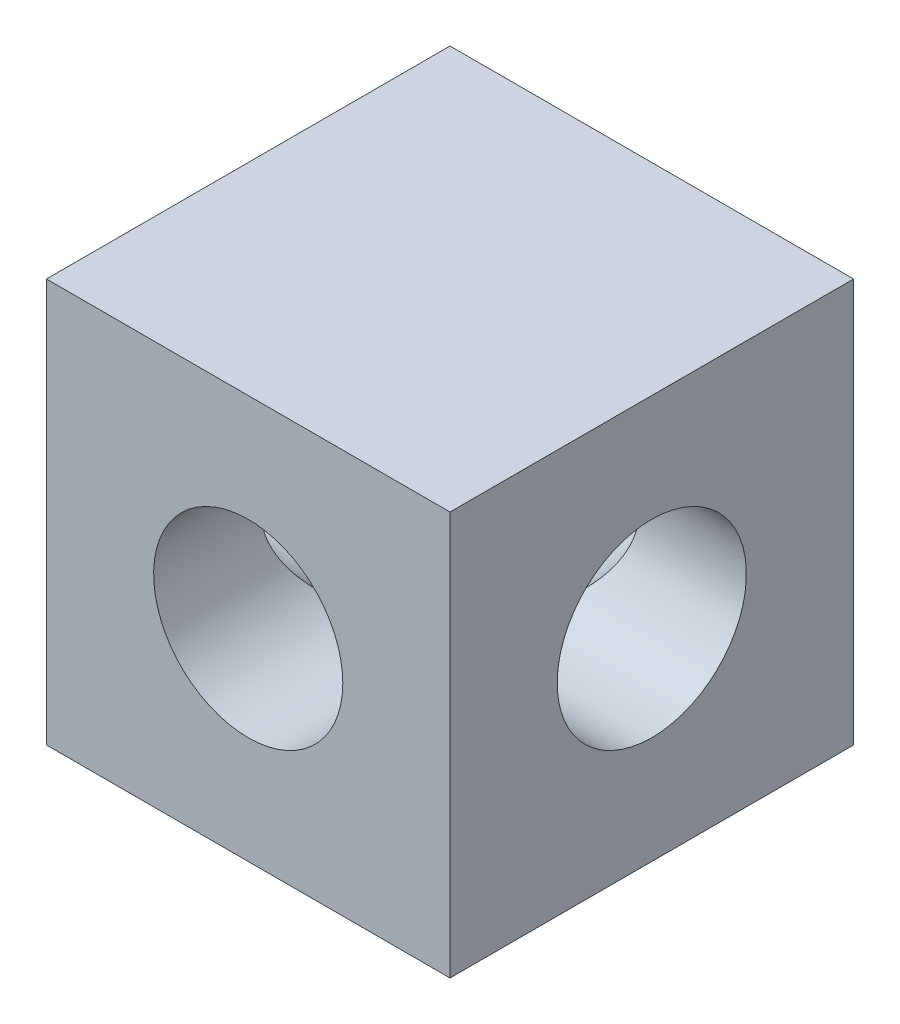
ISO-10303-21;
HEADER;
FILE_DESCRIPTION(('STEP AP214'),'2;1');
FILE_NAME('part.step','',(''),(''),'','','');
FILE_SCHEMA(('AUTOMOTIVE_DESIGN { 1 0 10303 214 1 1 1 1 }'));
ENDSEC;
DATA;
#1=APPLICATION_CONTEXT('core data for automotive mechanical design processes');
#2=APPLICATION_PROTOCOL_DEFINITION('international standard','automotive_design',2000,#1);
#3=PRODUCT_CONTEXT('',#1,'mechanical');
#4=PRODUCT('Part','Part','',(#3));
#5=PRODUCT_RELATED_PRODUCT_CATEGORY('part','',(#4));
#6=PRODUCT_DEFINITION_FORMATION('','',#4);
#7=PRODUCT_DEFINITION_CONTEXT('part definition',#1,'design');
#8=PRODUCT_DEFINITION('design','',#6,#7);
#9=PRODUCT_DEFINITION_SHAPE('','',#8);
#10=(LENGTH_UNIT() NAMED_UNIT(*) SI_UNIT(.MILLI.,.METRE.));
#11=(NAMED_UNIT(*) PLANE_ANGLE_UNIT() SI_UNIT($,.RADIAN.));
#12=(NAMED_UNIT(*) SI_UNIT($,.STERADIAN.) SOLID_ANGLE_UNIT());
#13=UNCERTAINTY_MEASURE_WITH_UNIT(LENGTH_MEASURE(1.E-05),#10,'distance_accuracy_value','');
#14=(GEOMETRIC_REPRESENTATION_CONTEXT(3) GLOBAL_UNCERTAINTY_ASSIGNED_CONTEXT((#13)) GLOBAL_UNIT_ASSIGNED_CONTEXT((#10,
#11,#12)) REPRESENTATION_CONTEXT('',''));
#15=CARTESIAN_POINT('',(0.,0.,0.));
#16=DIRECTION('',(0.,0.,1.));
#17=DIRECTION('',(1.,0.,0.));
#18=AXIS2_PLACEMENT_3D('',#15,#16,#17);
#19=CARTESIAN_POINT('',(-16.9782681564246,8.53525139664805,20.32));
#20=DIRECTION('',(0.,0.,-1.));
#21=DIRECTION('',(-1.,0.,0.));
#22=AXIS2_PLACEMENT_3D('',#19,#20,#21);
#23=CYLINDRICAL_SURFACE('',#22,4.7625);
#24=CARTESIAN_POINT('',(-16.9782681564246,8.53525139664805,10.16));
#25=DIRECTION('',(0.707106781186549,0.,-0.707106781186548));
#26=DIRECTION('',(-0.707106781186549,0.,-0.707106781186548));
#27=AXIS2_PLACEMENT_3D('',#24,#25,#26);
#28=ELLIPSE('',#27,6.73519209080187,4.7625);
#29=CARTESIAN_POINT('',(-16.9782681564246,3.77275139664804,10.16));
#30=VERTEX_POINT('',#29);
#31=CARTESIAN_POINT('',(-16.9782681564246,13.297751396648,10.16));
#32=VERTEX_POINT('',#31);
#33=EDGE_CURVE('E11',#30,#32,#28,.F.);
#34=ORIENTED_EDGE('',*,*,#33,.F.);
#35=CARTESIAN_POINT('',(-16.9782681564246,8.53525139664805,10.16));
#36=DIRECTION('',(-0.707106781186549,0.,-0.707106781186548));
#37=DIRECTION('',(0.707106781186549,0.,-0.707106781186548));
#38=AXIS2_PLACEMENT_3D('',#35,#36,#37);
#39=ELLIPSE('',#38,6.73519209080187,4.7625);
#40=EDGE_CURVE('E46',#32,#30,#39,.F.);
#41=ORIENTED_EDGE('',*,*,#40,.F.);
#42=EDGE_LOOP('',(#34,#41));
#43=FACE_BOUND('',#42,.T.);
#44=CARTESIAN_POINT('',(-16.9782681564246,8.53525139664805,20.32));
#45=DIRECTION('',(0.,0.,1.));
#46=DIRECTION('',(1.,0.,0.));
#47=AXIS2_PLACEMENT_3D('',#44,#45,#46);
#48=CIRCLE('',#47,4.7625);
#49=CARTESIAN_POINT('',(-12.2157681564246,8.53525139664805,20.32));
#50=VERTEX_POINT('',#49);
#51=EDGE_CURVE('E122',#50,#50,#48,.T.);
#52=ORIENTED_EDGE('',*,*,#51,.T.);
#53=EDGE_LOOP('',(#52));
#54=FACE_BOUND('',#53,.T.);
#55=ADVANCED_FACE('F32',(#43,#54),#23,.F.);
#56=CARTESIAN_POINT('',(-27.1382681564246,-1.62474860335195,20.32));
#57=DIRECTION('',(0.,0.,-1.));
#58=DIRECTION('',(-1.,0.,0.));
#59=AXIS2_PLACEMENT_3D('',#56,#57,#58);
#60=PLANE('',#59);
#61=DIRECTION('',(0.,0.999999999999999,0.));
#62=VECTOR('',#61,1.);
#63=CARTESIAN_POINT('',(-27.1382681564246,-1.62474860335195,20.32));
#64=LINE('',#63,#62);
#65=CARTESIAN_POINT('',(-27.1382681564246,-1.62474860335195,20.32));
#66=VERTEX_POINT('',#65);
#67=CARTESIAN_POINT('',(-27.1382681564246,18.695251396648,20.32));
#68=VERTEX_POINT('',#67);
#69=EDGE_CURVE('E108',#66,#68,#64,.T.);
#70=ORIENTED_EDGE('',*,*,#69,.F.);
#71=DIRECTION('',(1.,0.,0.));
#72=VECTOR('',#71,1.);
#73=CARTESIAN_POINT('',(-27.1382681564246,-1.62474860335195,20.32));
#74=LINE('',#73,#72);
#75=CARTESIAN_POINT('',(-6.8182681564246,-1.62474860335193,20.32));
#76=VERTEX_POINT('',#75);
#77=EDGE_CURVE('E97',#66,#76,#74,.T.);
#78=ORIENTED_EDGE('',*,*,#77,.T.);
#79=DIRECTION('',(0.,-0.999999999999999,0.));
#80=VECTOR('',#79,1.);
#81=CARTESIAN_POINT('',(-6.8182681564246,18.695251396648,20.32));
#82=LINE('',#81,#80);
#83=CARTESIAN_POINT('',(-6.8182681564246,18.695251396648,20.32));
#84=VERTEX_POINT('',#83);
#85=EDGE_CURVE('E103',#84,#76,#82,.T.);
#86=ORIENTED_EDGE('',*,*,#85,.F.);
#87=DIRECTION('',(-1.,0.,0.));
#88=VECTOR('',#87,1.);
#89=CARTESIAN_POINT('',(-6.8182681564246,18.695251396648,20.32));
#90=LINE('',#89,#88);
#91=EDGE_CURVE('E106',#84,#68,#90,.T.);
#92=ORIENTED_EDGE('',*,*,#91,.T.);
#93=EDGE_LOOP('',(#70,#78,#86,#92));
#94=FACE_BOUND('',#93,.T.);
#95=ORIENTED_EDGE('',*,*,#51,.F.);
#96=EDGE_LOOP('',(#95));
#97=FACE_BOUND('',#96,.T.);
#98=ADVANCED_FACE('F154',(#94,#97),#60,.F.);
#99=CARTESIAN_POINT('',(-27.1382681564246,-1.62474860335197,0.));
#100=DIRECTION('',(0.,0.,-1.));
#101=DIRECTION('',(-1.,0.,0.));
#102=AXIS2_PLACEMENT_3D('',#99,#100,#101);
#103=PLANE('',#102);
#104=DIRECTION('',(0.,0.999999999999999,0.));
#105=VECTOR('',#104,1.);
#106=CARTESIAN_POINT('',(-27.1382681564246,-1.62474860335197,0.));
#107=LINE('',#106,#105);
#108=CARTESIAN_POINT('',(-27.1382681564246,-1.62474860335197,0.));
#109=VERTEX_POINT('',#108);
#110=CARTESIAN_POINT('',(-27.1382681564247,18.695251396648,0.));
#111=VERTEX_POINT('',#110);
#112=EDGE_CURVE('E119',#109,#111,#107,.T.);
#113=ORIENTED_EDGE('',*,*,#112,.T.);
#114=DIRECTION('',(-1.,0.,0.));
#115=VECTOR('',#114,1.);
#116=CARTESIAN_POINT('',(-6.8182681564246,18.695251396648,0.));
#117=LINE('',#116,#115);
#118=CARTESIAN_POINT('',(-6.8182681564246,18.695251396648,0.));
#119=VERTEX_POINT('',#118);
#120=EDGE_CURVE('E116',#119,#111,#117,.T.);
#121=ORIENTED_EDGE('',*,*,#120,.F.);
#122=DIRECTION('',(0.,-0.999999999999999,0.));
#123=VECTOR('',#122,1.);
#124=CARTESIAN_POINT('',(-6.8182681564246,18.695251396648,0.));
#125=LINE('',#124,#123);
#126=CARTESIAN_POINT('',(-6.8182681564246,-1.62474860335193,0.));
#127=VERTEX_POINT('',#126);
#128=EDGE_CURVE('E113',#119,#127,#125,.T.);
#129=ORIENTED_EDGE('',*,*,#128,.T.);
#130=DIRECTION('',(1.,0.,0.));
#131=VECTOR('',#130,1.);
#132=CARTESIAN_POINT('',(-27.1382681564246,-1.62474860335197,0.));
#133=LINE('',#132,#131);
#134=EDGE_CURVE('E110',#109,#127,#133,.T.);
#135=ORIENTED_EDGE('',*,*,#134,.F.);
#136=EDGE_LOOP('',(#113,#121,#129,#135));
#137=FACE_BOUND('',#136,.T.);
#138=CARTESIAN_POINT('',(-16.9782681564246,8.53525139664805,0.));
#139=DIRECTION('',(0.,0.,1.));
#140=DIRECTION('',(1.,0.,0.));
#141=AXIS2_PLACEMENT_3D('',#138,#139,#140);
#142=CIRCLE('',#141,4.7625);
#143=CARTESIAN_POINT('',(-12.2157681564246,8.53525139664805,0.));
#144=VERTEX_POINT('',#143);
#145=EDGE_CURVE('E125',#144,#144,#142,.T.);
#146=ORIENTED_EDGE('',*,*,#145,.T.);
#147=EDGE_LOOP('',(#146));
#148=FACE_BOUND('',#147,.T.);
#149=ADVANCED_FACE('F147',(#137,#148),#103,.T.);
#150=CARTESIAN_POINT('',(-27.1382681564246,-1.62474860335195,20.32));
#151=DIRECTION('',(-1.,0.,0.));
#152=DIRECTION('',(0.,-0.999999999999999,0.));
#153=AXIS2_PLACEMENT_3D('',#150,#151,#152);
#154=PLANE('',#153);
#155=CARTESIAN_POINT('',(-27.1382681564246,8.53525139664801,10.16));
#156=DIRECTION('',(1.,0.,0.));
#157=DIRECTION('',(0.,0.999999999999999,0.));
#158=AXIS2_PLACEMENT_3D('',#155,#156,#157);
#159=CIRCLE('',#158,4.7625);
#160=CARTESIAN_POINT('',(-27.1382681564246,13.297751396648,10.16));
#161=VERTEX_POINT('',#160);
#162=EDGE_CURVE('E128',#161,#161,#159,.T.);
#163=ORIENTED_EDGE('',*,*,#162,.T.);
#164=EDGE_LOOP('',(#163));
#165=FACE_BOUND('',#164,.T.);
#166=ORIENTED_EDGE('',*,*,#112,.F.);
#167=DIRECTION('',(0.,0.,-1.));
#168=VECTOR('',#167,1.);
#169=CARTESIAN_POINT('',(-27.1382681564246,-1.62474860335195,20.32));
#170=LINE('',#169,#168);
#171=EDGE_CURVE('E54',#66,#109,#170,.T.);
#172=ORIENTED_EDGE('',*,*,#171,.F.);
#173=ORIENTED_EDGE('',*,*,#69,.T.);
#174=DIRECTION('',(0.,0.,-1.));
#175=VECTOR('',#174,1.);
#176=CARTESIAN_POINT('',(-27.1382681564246,18.695251396648,20.32));
#177=LINE('',#176,#175);
#178=EDGE_CURVE('E94',#68,#111,#177,.T.);
#179=ORIENTED_EDGE('',*,*,#178,.T.);
#180=EDGE_LOOP('',(#166,#172,#173,#179));
#181=FACE_BOUND('',#180,.T.);
#182=ADVANCED_FACE('F34',(#165,#181),#154,.T.);
#183=CARTESIAN_POINT('',(-27.1382681564246,-1.62474860335195,20.32));
#184=DIRECTION('',(0.,0.999999999999999,0.));
#185=DIRECTION('',(0.,0.,1.));
#186=AXIS2_PLACEMENT_3D('',#183,#184,#185);
#187=PLANE('',#186);
#188=ORIENTED_EDGE('',*,*,#134,.T.);
#189=DIRECTION('',(0.,0.,-1.));
#190=VECTOR('',#189,1.);
#191=CARTESIAN_POINT('',(-6.8182681564246,-1.62474860335193,20.32));
#192=LINE('',#191,#190);
#193=EDGE_CURVE('E99',#76,#127,#192,.T.);
#194=ORIENTED_EDGE('',*,*,#193,.F.);
#195=ORIENTED_EDGE('',*,*,#77,.F.);
#196=ORIENTED_EDGE('',*,*,#171,.T.);
#197=EDGE_LOOP('',(#188,#194,#195,#196));
#198=FACE_BOUND('',#197,.T.);
#199=ADVANCED_FACE('F139',(#198),#187,.F.);
#200=CARTESIAN_POINT('',(-6.8182681564246,18.695251396648,20.32));
#201=DIRECTION('',(1.,0.,0.));
#202=DIRECTION('',(0.,0.999999999999999,0.));
#203=AXIS2_PLACEMENT_3D('',#200,#201,#202);
#204=PLANE('',#203);
#205=CARTESIAN_POINT('',(-6.8182681564246,8.53525139664803,10.16));
#206=DIRECTION('',(1.,0.,0.));
#207=DIRECTION('',(0.,0.999999999999999,0.));
#208=AXIS2_PLACEMENT_3D('',#205,#206,#207);
#209=CIRCLE('',#208,4.7625);
#210=CARTESIAN_POINT('',(-6.8182681564246,13.297751396648,10.16));
#211=VERTEX_POINT('',#210);
#212=EDGE_CURVE('E131',#211,#211,#209,.T.);
#213=ORIENTED_EDGE('',*,*,#212,.F.);
#214=EDGE_LOOP('',(#213));
#215=FACE_BOUND('',#214,.T.);
#216=ORIENTED_EDGE('',*,*,#128,.F.);
#217=DIRECTION('',(0.,0.,-1.));
#218=VECTOR('',#217,1.);
#219=CARTESIAN_POINT('',(-6.8182681564246,18.695251396648,20.32));
#220=LINE('',#219,#218);
#221=EDGE_CURVE('E96',#84,#119,#220,.T.);
#222=ORIENTED_EDGE('',*,*,#221,.F.);
#223=ORIENTED_EDGE('',*,*,#85,.T.);
#224=ORIENTED_EDGE('',*,*,#193,.T.);
#225=EDGE_LOOP('',(#216,#222,#223,#224));
#226=FACE_BOUND('',#225,.T.);
#227=ADVANCED_FACE('F135',(#215,#226),#204,.T.);
#228=CARTESIAN_POINT('',(-6.8182681564246,18.695251396648,20.32));
#229=DIRECTION('',(0.,-0.999999999999999,0.));
#230=DIRECTION('',(1.,0.,0.));
#231=AXIS2_PLACEMENT_3D('',#228,#229,#230);
#232=PLANE('',#231);
#233=ORIENTED_EDGE('',*,*,#120,.T.);
#234=ORIENTED_EDGE('',*,*,#178,.F.);
#235=ORIENTED_EDGE('',*,*,#91,.F.);
#236=ORIENTED_EDGE('',*,*,#221,.T.);
#237=EDGE_LOOP('',(#233,#234,#235,#236));
#238=FACE_BOUND('',#237,.T.);
#239=ADVANCED_FACE('F138',(#238),#232,.F.);
#240=CARTESIAN_POINT('',(-16.9782681564246,8.53525139664805,10.16));
#241=DIRECTION('',(0.707106781186549,0.,-0.707106781186548));
#242=DIRECTION('',(-0.707106781186549,0.,-0.707106781186548));
#243=AXIS2_PLACEMENT_3D('',#240,#241,#242);
#244=ELLIPSE('',#243,6.73519209080187,4.7625);
#245=EDGE_CURVE('E40',#30,#32,#244,.T.);
#246=ORIENTED_EDGE('',*,*,#245,.F.);
#247=CARTESIAN_POINT('',(-16.9782681564246,8.53525139664805,10.16));
#248=DIRECTION('',(-0.707106781186549,0.,-0.707106781186548));
#249=DIRECTION('',(0.707106781186549,0.,-0.707106781186548));
#250=AXIS2_PLACEMENT_3D('',#247,#248,#249);
#251=ELLIPSE('',#250,6.73519209080187,4.7625);
#252=EDGE_CURVE('E80',#32,#30,#251,.T.);
#253=ORIENTED_EDGE('',*,*,#252,.F.);
#254=EDGE_LOOP('',(#246,#253));
#255=FACE_BOUND('',#254,.T.);
#256=ORIENTED_EDGE('',*,*,#145,.F.);
#257=EDGE_LOOP('',(#256));
#258=FACE_BOUND('',#257,.T.);
#259=ADVANCED_FACE('F91',(#255,#258),#23,.F.);
#260=CARTESIAN_POINT('',(-27.1382681564246,8.53525139664801,10.16));
#261=DIRECTION('',(1.,0.,0.));
#262=DIRECTION('',(0.,0.999999999999999,0.));
#263=AXIS2_PLACEMENT_3D('',#260,#261,#262);
#264=CYLINDRICAL_SURFACE('',#263,4.7625);
#265=ORIENTED_EDGE('',*,*,#245,.T.);
#266=ORIENTED_EDGE('',*,*,#40,.T.);
#267=EDGE_LOOP('',(#265,#266));
#268=FACE_BOUND('',#267,.T.);
#269=ORIENTED_EDGE('',*,*,#162,.F.);
#270=EDGE_LOOP('',(#269));
#271=FACE_BOUND('',#270,.T.);
#272=ADVANCED_FACE('F87',(#268,#271),#264,.F.);
#273=ORIENTED_EDGE('',*,*,#33,.T.);
#274=ORIENTED_EDGE('',*,*,#252,.T.);
#275=EDGE_LOOP('',(#273,#274));
#276=FACE_BOUND('',#275,.T.);
#277=ORIENTED_EDGE('',*,*,#212,.T.);
#278=EDGE_LOOP('',(#277));
#279=FACE_BOUND('',#278,.T.);
#280=ADVANCED_FACE('F81',(#276,#279),#264,.F.);
#281=CLOSED_SHELL('',(#55,#98,#149,#182,#199,#227,#239,#259,#272,#280));
#282=MANIFOLD_SOLID_BREP('B2',#281);
#283=ADVANCED_BREP_SHAPE_REPRESENTATION('',(#18,#282),#14);
#284=SHAPE_DEFINITION_REPRESENTATION(#9,#283);
ENDSEC;
END-ISO-10303-21;
